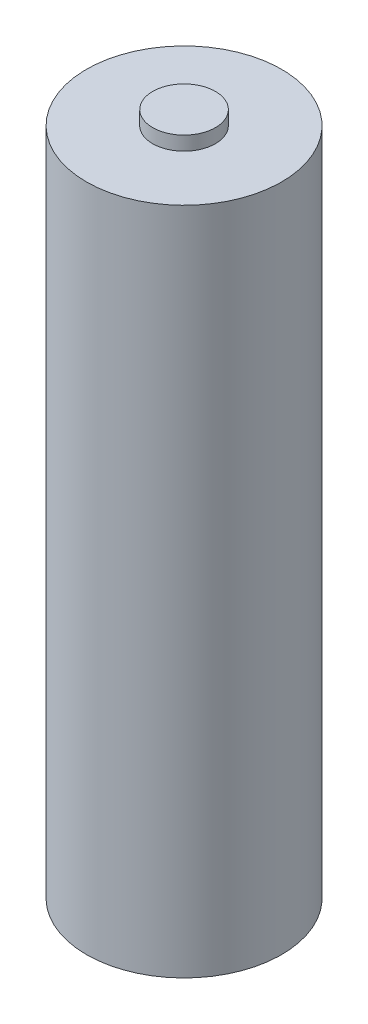
ISO-10303-21;
HEADER;
FILE_DESCRIPTION(('STEP AP214'),'2;1');
FILE_NAME('part.step','',(''),(''),'','','');
FILE_SCHEMA(('AUTOMOTIVE_DESIGN { 1 0 10303 214 1 1 1 1 }'));
ENDSEC;
DATA;
#1=APPLICATION_CONTEXT('core data for automotive mechanical design processes');
#2=APPLICATION_PROTOCOL_DEFINITION('international standard','automotive_design',2000,#1);
#3=PRODUCT_CONTEXT('',#1,'mechanical');
#4=PRODUCT('Part','Part','',(#3));
#5=PRODUCT_RELATED_PRODUCT_CATEGORY('part','',(#4));
#6=PRODUCT_DEFINITION_FORMATION('','',#4);
#7=PRODUCT_DEFINITION_CONTEXT('part definition',#1,'design');
#8=PRODUCT_DEFINITION('design','',#6,#7);
#9=PRODUCT_DEFINITION_SHAPE('','',#8);
#10=(LENGTH_UNIT() NAMED_UNIT(*) SI_UNIT(.MILLI.,.METRE.));
#11=(NAMED_UNIT(*) PLANE_ANGLE_UNIT() SI_UNIT($,.RADIAN.));
#12=(NAMED_UNIT(*) SI_UNIT($,.STERADIAN.) SOLID_ANGLE_UNIT());
#13=UNCERTAINTY_MEASURE_WITH_UNIT(LENGTH_MEASURE(1.E-05),#10,'distance_accuracy_value','');
#14=(GEOMETRIC_REPRESENTATION_CONTEXT(3) GLOBAL_UNCERTAINTY_ASSIGNED_CONTEXT((#13)) GLOBAL_UNIT_ASSIGNED_CONTEXT((#10,
#11,#12)) REPRESENTATION_CONTEXT('',''));
#15=CARTESIAN_POINT('',(0.,0.,0.));
#16=DIRECTION('',(0.,0.,1.));
#17=DIRECTION('',(1.,0.,0.));
#18=AXIS2_PLACEMENT_3D('',#15,#16,#17);
#19=CARTESIAN_POINT('',(0.,48.,0.));
#20=DIRECTION('',(0.,-1.,0.));
#21=DIRECTION('',(0.,0.,-1.));
#22=AXIS2_PLACEMENT_3D('',#19,#20,#21);
#23=CYLINDRICAL_SURFACE('',#22,7.);
#24=CARTESIAN_POINT('',(0.,48.,0.));
#25=DIRECTION('',(0.,1.,0.));
#26=DIRECTION('',(0.,0.,1.));
#27=AXIS2_PLACEMENT_3D('',#24,#25,#26);
#28=CIRCLE('',#27,7.);
#29=CARTESIAN_POINT('',(0.,48.,7.));
#30=VERTEX_POINT('',#29);
#31=EDGE_CURVE('E10',#30,#30,#28,.T.);
#32=ORIENTED_EDGE('',*,*,#31,.F.);
#33=EDGE_LOOP('',(#32));
#34=FACE_BOUND('',#33,.T.);
#35=CARTESIAN_POINT('',(0.,0.,0.));
#36=DIRECTION('',(0.,1.,0.));
#37=DIRECTION('',(0.,0.,1.));
#38=AXIS2_PLACEMENT_3D('',#35,#36,#37);
#39=CIRCLE('',#38,7.);
#40=CARTESIAN_POINT('',(0.,0.,7.));
#41=VERTEX_POINT('',#40);
#42=EDGE_CURVE('E38',#41,#41,#39,.T.);
#43=ORIENTED_EDGE('',*,*,#42,.T.);
#44=EDGE_LOOP('',(#43));
#45=FACE_BOUND('',#44,.T.);
#46=ADVANCED_FACE('F35',(#34,#45),#23,.T.);
#47=CARTESIAN_POINT('',(0.,48.,0.));
#48=DIRECTION('',(0.,1.,0.));
#49=DIRECTION('',(0.,0.,1.));
#50=AXIS2_PLACEMENT_3D('',#47,#48,#49);
#51=PLANE('',#50);
#52=CARTESIAN_POINT('',(0.,48.,0.));
#53=DIRECTION('',(0.,1.,0.));
#54=DIRECTION('',(0.,0.,1.));
#55=AXIS2_PLACEMENT_3D('',#52,#53,#54);
#56=CIRCLE('',#55,2.25);
#57=CARTESIAN_POINT('',(0.,48.,2.25));
#58=VERTEX_POINT('',#57);
#59=EDGE_CURVE('E47',#58,#58,#56,.T.);
#60=ORIENTED_EDGE('',*,*,#59,.F.);
#61=EDGE_LOOP('',(#60));
#62=FACE_BOUND('',#61,.T.);
#63=ORIENTED_EDGE('',*,*,#31,.T.);
#64=EDGE_LOOP('',(#63));
#65=FACE_BOUND('',#64,.T.);
#66=ADVANCED_FACE('F90',(#62,#65),#51,.T.);
#67=CARTESIAN_POINT('',(0.,0.,0.));
#68=DIRECTION('',(0.,1.,0.));
#69=DIRECTION('',(0.,0.,1.));
#70=AXIS2_PLACEMENT_3D('',#67,#68,#69);
#71=PLANE('',#70);
#72=CARTESIAN_POINT('',(0.,0.,0.));
#73=DIRECTION('',(0.,1.,0.));
#74=DIRECTION('',(0.,0.,1.));
#75=AXIS2_PLACEMENT_3D('',#72,#73,#74);
#76=CIRCLE('',#75,4.5);
#77=CARTESIAN_POINT('',(0.,0.,4.5));
#78=VERTEX_POINT('',#77);
#79=EDGE_CURVE('E53',#78,#78,#76,.T.);
#80=ORIENTED_EDGE('',*,*,#79,.T.);
#81=EDGE_LOOP('',(#80));
#82=FACE_BOUND('',#81,.T.);
#83=ORIENTED_EDGE('',*,*,#42,.F.);
#84=EDGE_LOOP('',(#83));
#85=FACE_BOUND('',#84,.T.);
#86=ADVANCED_FACE('F95',(#82,#85),#71,.F.);
#87=CARTESIAN_POINT('',(0.,49.,0.));
#88=DIRECTION('',(0.,-1.,0.));
#89=DIRECTION('',(0.,0.,-1.));
#90=AXIS2_PLACEMENT_3D('',#87,#88,#89);
#91=CYLINDRICAL_SURFACE('',#90,2.25);
#92=CARTESIAN_POINT('',(0.,49.,0.));
#93=DIRECTION('',(0.,1.,0.));
#94=DIRECTION('',(0.,0.,1.));
#95=AXIS2_PLACEMENT_3D('',#92,#93,#94);
#96=CIRCLE('',#95,2.25);
#97=CARTESIAN_POINT('',(0.,49.,2.25));
#98=VERTEX_POINT('',#97);
#99=EDGE_CURVE('E45',#98,#98,#96,.T.);
#100=ORIENTED_EDGE('',*,*,#99,.F.);
#101=EDGE_LOOP('',(#100));
#102=FACE_BOUND('',#101,.T.);
#103=ORIENTED_EDGE('',*,*,#59,.T.);
#104=EDGE_LOOP('',(#103));
#105=FACE_BOUND('',#104,.T.);
#106=ADVANCED_FACE('F102',(#102,#105),#91,.T.);
#107=CARTESIAN_POINT('',(0.,49.,0.));
#108=DIRECTION('',(0.,1.,0.));
#109=DIRECTION('',(0.,0.,1.));
#110=AXIS2_PLACEMENT_3D('',#107,#108,#109);
#111=PLANE('',#110);
#112=ORIENTED_EDGE('',*,*,#99,.T.);
#113=EDGE_LOOP('',(#112));
#114=FACE_BOUND('',#113,.T.);
#115=ADVANCED_FACE('F107',(#114),#111,.T.);
#116=CARTESIAN_POINT('',(0.,-0.5,0.));
#117=DIRECTION('',(0.,1.,0.));
#118=DIRECTION('',(0.,0.,1.));
#119=AXIS2_PLACEMENT_3D('',#116,#117,#118);
#120=CYLINDRICAL_SURFACE('',#119,4.5);
#121=CARTESIAN_POINT('',(0.,-0.5,0.));
#122=DIRECTION('',(0.,1.,0.));
#123=DIRECTION('',(0.,0.,1.));
#124=AXIS2_PLACEMENT_3D('',#121,#122,#123);
#125=CIRCLE('',#124,4.5);
#126=CARTESIAN_POINT('',(0.,-0.5,4.5));
#127=VERTEX_POINT('',#126);
#128=EDGE_CURVE('E50',#127,#127,#125,.T.);
#129=ORIENTED_EDGE('',*,*,#128,.T.);
#130=EDGE_LOOP('',(#129));
#131=FACE_BOUND('',#130,.T.);
#132=ORIENTED_EDGE('',*,*,#79,.F.);
#133=EDGE_LOOP('',(#132));
#134=FACE_BOUND('',#133,.T.);
#135=ADVANCED_FACE('F87',(#131,#134),#120,.T.);
#136=CARTESIAN_POINT('',(0.,-0.5,0.));
#137=DIRECTION('',(0.,1.,0.));
#138=DIRECTION('',(0.,0.,1.));
#139=AXIS2_PLACEMENT_3D('',#136,#137,#138);
#140=PLANE('',#139);
#141=CARTESIAN_POINT('',(0.,-0.5,0.));
#142=DIRECTION('',(0.,1.,0.));
#143=DIRECTION('',(0.,0.,1.));
#144=AXIS2_PLACEMENT_3D('',#141,#142,#143);
#145=CIRCLE('',#144,3.);
#146=CARTESIAN_POINT('',(0.,-0.5,3.));
#147=VERTEX_POINT('',#146);
#148=EDGE_CURVE('E56',#147,#147,#145,.T.);
#149=ORIENTED_EDGE('',*,*,#148,.T.);
#150=EDGE_LOOP('',(#149));
#151=FACE_BOUND('',#150,.T.);
#152=ORIENTED_EDGE('',*,*,#128,.F.);
#153=EDGE_LOOP('',(#152));
#154=FACE_BOUND('',#153,.T.);
#155=ADVANCED_FACE('F77',(#151,#154),#140,.F.);
#156=CARTESIAN_POINT('',(0.,-0.5,0.));
#157=DIRECTION('',(0.,1.,0.));
#158=DIRECTION('',(0.,0.,1.));
#159=AXIS2_PLACEMENT_3D('',#156,#157,#158);
#160=CYLINDRICAL_SURFACE('',#159,3.);
#161=ORIENTED_EDGE('',*,*,#148,.F.);
#162=EDGE_LOOP('',(#161));
#163=FACE_BOUND('',#162,.T.);
#164=CARTESIAN_POINT('',(0.,0.,0.));
#165=DIRECTION('',(0.,1.,0.));
#166=DIRECTION('',(0.,0.,1.));
#167=AXIS2_PLACEMENT_3D('',#164,#165,#166);
#168=CIRCLE('',#167,3.);
#169=CARTESIAN_POINT('',(0.,0.,3.));
#170=VERTEX_POINT('',#169);
#171=EDGE_CURVE('E59',#170,#170,#168,.T.);
#172=ORIENTED_EDGE('',*,*,#171,.T.);
#173=EDGE_LOOP('',(#172));
#174=FACE_BOUND('',#173,.T.);
#175=ADVANCED_FACE('F86',(#163,#174),#160,.F.);
#176=CARTESIAN_POINT('',(0.,0.,0.));
#177=DIRECTION('',(0.,1.,0.));
#178=DIRECTION('',(0.,0.,1.));
#179=AXIS2_PLACEMENT_3D('',#176,#177,#178);
#180=PLANE('',#179);
#181=CARTESIAN_POINT('',(0.,0.,0.));
#182=DIRECTION('',(0.,1.,0.));
#183=DIRECTION('',(0.,0.,1.));
#184=AXIS2_PLACEMENT_3D('',#181,#182,#183);
#185=CIRCLE('',#184,2.5);
#186=CARTESIAN_POINT('',(0.,0.,2.5));
#187=VERTEX_POINT('',#186);
#188=EDGE_CURVE('E65',#187,#187,#185,.T.);
#189=ORIENTED_EDGE('',*,*,#188,.T.);
#190=EDGE_LOOP('',(#189));
#191=FACE_BOUND('',#190,.T.);
#192=ORIENTED_EDGE('',*,*,#171,.F.);
#193=EDGE_LOOP('',(#192));
#194=FACE_BOUND('',#193,.T.);
#195=ADVANCED_FACE('F81',(#191,#194),#180,.F.);
#196=CARTESIAN_POINT('',(0.,-0.5,0.));
#197=DIRECTION('',(0.,1.,0.));
#198=DIRECTION('',(0.,0.,1.));
#199=AXIS2_PLACEMENT_3D('',#196,#197,#198);
#200=CYLINDRICAL_SURFACE('',#199,2.5);
#201=CARTESIAN_POINT('',(0.,-0.5,0.));
#202=DIRECTION('',(0.,1.,0.));
#203=DIRECTION('',(0.,0.,1.));
#204=AXIS2_PLACEMENT_3D('',#201,#202,#203);
#205=CIRCLE('',#204,2.5);
#206=CARTESIAN_POINT('',(0.,-0.5,2.5));
#207=VERTEX_POINT('',#206);
#208=EDGE_CURVE('E62',#207,#207,#205,.T.);
#209=ORIENTED_EDGE('',*,*,#208,.T.);
#210=EDGE_LOOP('',(#209));
#211=FACE_BOUND('',#210,.T.);
#212=ORIENTED_EDGE('',*,*,#188,.F.);
#213=EDGE_LOOP('',(#212));
#214=FACE_BOUND('',#213,.T.);
#215=ADVANCED_FACE('F71',(#211,#214),#200,.T.);
#216=ORIENTED_EDGE('',*,*,#208,.F.);
#217=EDGE_LOOP('',(#216));
#218=FACE_BOUND('',#217,.T.);
#219=ADVANCED_FACE('F74',(#218),#140,.F.);
#220=CLOSED_SHELL('',(#46,#66,#86,#106,#115,#135,#155,#175,#195,#215,#219));
#221=MANIFOLD_SOLID_BREP('B2',#220);
#222=ADVANCED_BREP_SHAPE_REPRESENTATION('',(#18,#221),#14);
#223=SHAPE_DEFINITION_REPRESENTATION(#9,#222);
ENDSEC;
END-ISO-10303-21;
